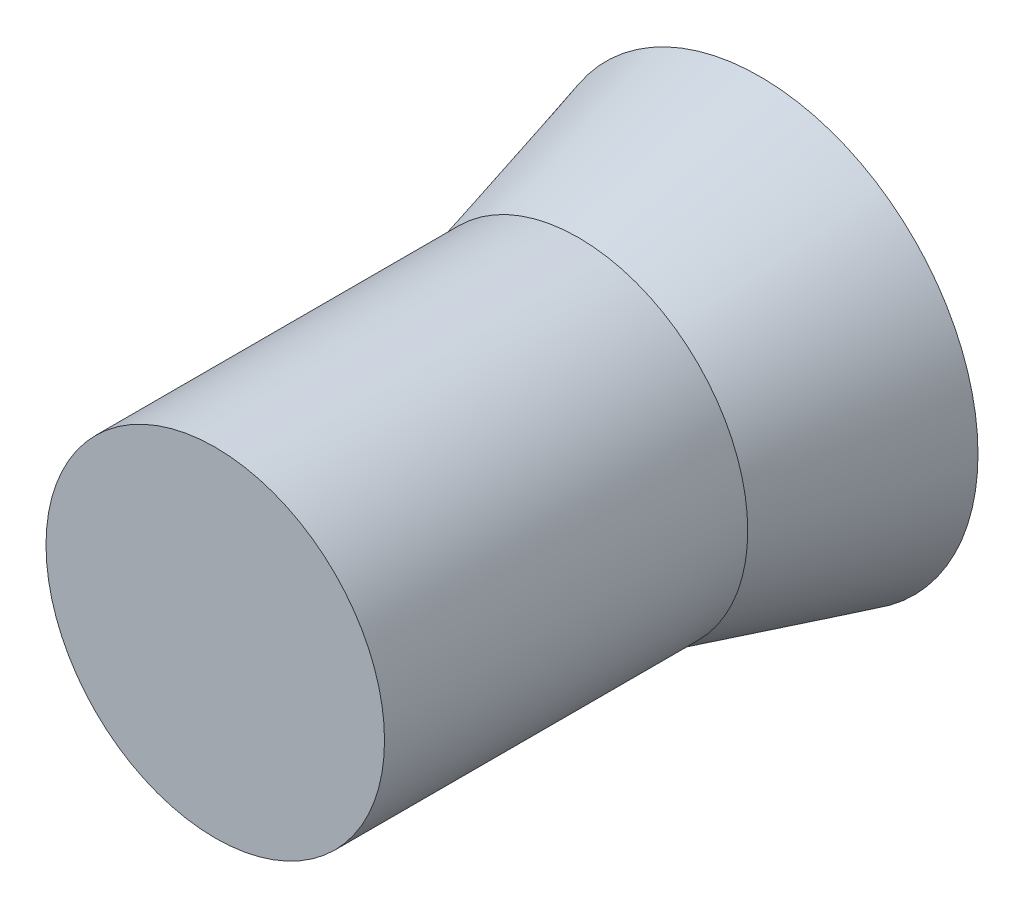
ISO-10303-21;
HEADER;
FILE_DESCRIPTION(('STEP AP214'),'2;1');
FILE_NAME('part.step','',(''),(''),'','','');
FILE_SCHEMA(('AUTOMOTIVE_DESIGN { 1 0 10303 214 1 1 1 1 }'));
ENDSEC;
DATA;
#1=APPLICATION_CONTEXT('core data for automotive mechanical design processes');
#2=APPLICATION_PROTOCOL_DEFINITION('international standard','automotive_design',2000,#1);
#3=PRODUCT_CONTEXT('',#1,'mechanical');
#4=PRODUCT('Part','Part','',(#3));
#5=PRODUCT_RELATED_PRODUCT_CATEGORY('part','',(#4));
#6=PRODUCT_DEFINITION_FORMATION('','',#4);
#7=PRODUCT_DEFINITION_CONTEXT('part definition',#1,'design');
#8=PRODUCT_DEFINITION('design','',#6,#7);
#9=PRODUCT_DEFINITION_SHAPE('','',#8);
#10=(LENGTH_UNIT() NAMED_UNIT(*) SI_UNIT(.MILLI.,.METRE.));
#11=(NAMED_UNIT(*) PLANE_ANGLE_UNIT() SI_UNIT($,.RADIAN.));
#12=(NAMED_UNIT(*) SI_UNIT($,.STERADIAN.) SOLID_ANGLE_UNIT());
#13=UNCERTAINTY_MEASURE_WITH_UNIT(LENGTH_MEASURE(1.E-05),#10,'distance_accuracy_value','');
#14=(GEOMETRIC_REPRESENTATION_CONTEXT(3) GLOBAL_UNCERTAINTY_ASSIGNED_CONTEXT((#13)) GLOBAL_UNIT_ASSIGNED_CONTEXT((#10,
#11,#12)) REPRESENTATION_CONTEXT('',''));
#15=CARTESIAN_POINT('',(0.,0.,0.));
#16=DIRECTION('',(0.,0.,1.));
#17=DIRECTION('',(1.,0.,0.));
#18=AXIS2_PLACEMENT_3D('',#15,#16,#17);
#19=CARTESIAN_POINT('',(0.,0.,0.));
#20=DIRECTION('',(0.,0.,-1.));
#21=DIRECTION('',(1.,0.,0.));
#22=AXIS2_PLACEMENT_3D('',#19,#20,#21);
#23=CONICAL_SURFACE('',#22,2.4,0.26179938779915);
#24=CARTESIAN_POINT('',(0.,0.,2.));
#25=DIRECTION('',(0.,0.,1.));
#26=DIRECTION('',(1.,0.,0.));
#27=AXIS2_PLACEMENT_3D('',#24,#25,#26);
#28=CIRCLE('',#27,1.86410161513775);
#29=CARTESIAN_POINT('',(1.86410161513775,0.,2.));
#30=VERTEX_POINT('',#29);
#31=EDGE_CURVE('E10',#30,#30,#28,.T.);
#32=ORIENTED_EDGE('',*,*,#31,.F.);
#33=EDGE_LOOP('',(#32));
#34=FACE_BOUND('',#33,.T.);
#35=CARTESIAN_POINT('',(0.,0.,0.));
#36=DIRECTION('',(0.,0.,1.));
#37=DIRECTION('',(1.,0.,0.));
#38=AXIS2_PLACEMENT_3D('',#35,#36,#37);
#39=CIRCLE('',#38,2.4);
#40=CARTESIAN_POINT('',(2.4,0.,0.));
#41=VERTEX_POINT('',#40);
#42=EDGE_CURVE('E39',#41,#41,#39,.T.);
#43=ORIENTED_EDGE('',*,*,#42,.T.);
#44=EDGE_LOOP('',(#43));
#45=FACE_BOUND('',#44,.T.);
#46=ADVANCED_FACE('F33',(#34,#45),#23,.T.);
#47=CARTESIAN_POINT('',(0.,0.,0.));
#48=DIRECTION('',(0.,0.,1.));
#49=DIRECTION('',(1.,0.,0.));
#50=AXIS2_PLACEMENT_3D('',#47,#48,#49);
#51=PLANE('',#50);
#52=ORIENTED_EDGE('',*,*,#42,.F.);
#53=EDGE_LOOP('',(#52));
#54=FACE_BOUND('',#53,.T.);
#55=ADVANCED_FACE('F54',(#54),#51,.F.);
#56=CARTESIAN_POINT('',(0.,0.,6.));
#57=DIRECTION('',(0.,0.,-1.));
#58=DIRECTION('',(-1.,0.,0.));
#59=AXIS2_PLACEMENT_3D('',#56,#57,#58);
#60=CYLINDRICAL_SURFACE('',#59,1.86410161513775);
#61=CARTESIAN_POINT('',(0.,0.,6.));
#62=DIRECTION('',(0.,0.,1.));
#63=DIRECTION('',(1.,0.,0.));
#64=AXIS2_PLACEMENT_3D('',#61,#62,#63);
#65=CIRCLE('',#64,1.86410161513775);
#66=CARTESIAN_POINT('',(1.86410161513775,0.,6.));
#67=VERTEX_POINT('',#66);
#68=EDGE_CURVE('E43',#67,#67,#65,.T.);
#69=ORIENTED_EDGE('',*,*,#68,.F.);
#70=EDGE_LOOP('',(#69));
#71=FACE_BOUND('',#70,.T.);
#72=ORIENTED_EDGE('',*,*,#31,.T.);
#73=EDGE_LOOP('',(#72));
#74=FACE_BOUND('',#73,.T.);
#75=ADVANCED_FACE('F52',(#71,#74),#60,.T.);
#76=CARTESIAN_POINT('',(0.,0.,6.));
#77=DIRECTION('',(0.,0.,1.));
#78=DIRECTION('',(1.,0.,0.));
#79=AXIS2_PLACEMENT_3D('',#76,#77,#78);
#80=PLANE('',#79);
#81=ORIENTED_EDGE('',*,*,#68,.T.);
#82=EDGE_LOOP('',(#81));
#83=FACE_BOUND('',#82,.T.);
#84=ADVANCED_FACE('F50',(#83),#80,.T.);
#85=CLOSED_SHELL('',(#46,#55,#75,#84));
#86=MANIFOLD_SOLID_BREP('B2',#85);
#87=ADVANCED_BREP_SHAPE_REPRESENTATION('',(#18,#86),#14);
#88=SHAPE_DEFINITION_REPRESENTATION(#9,#87);
ENDSEC;
END-ISO-10303-21;
